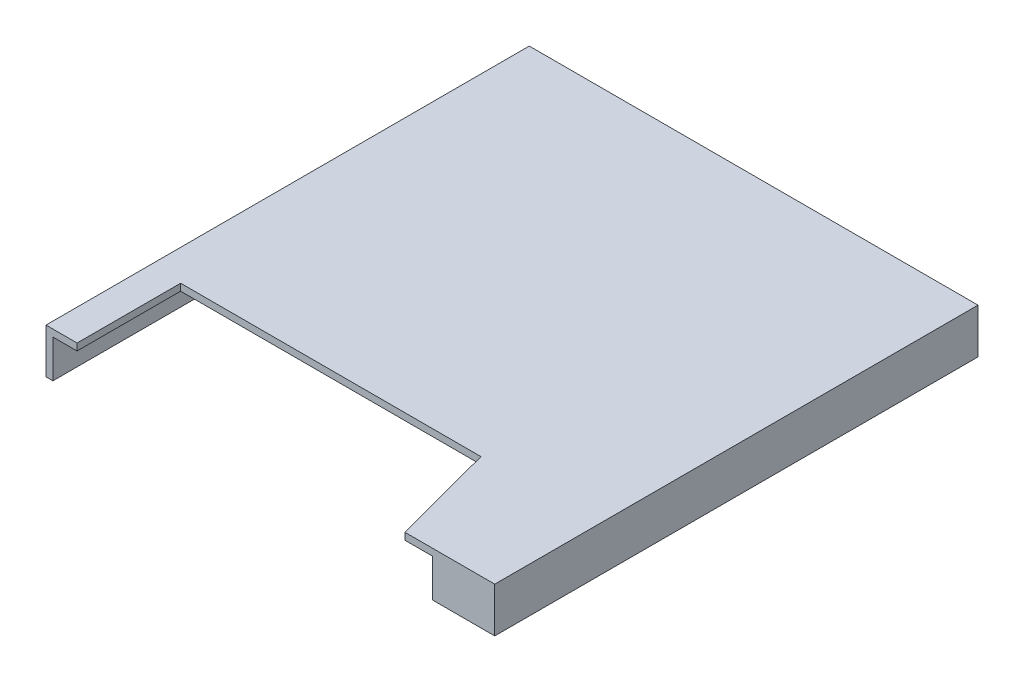
ISO-10303-21;
HEADER;
FILE_DESCRIPTION(('STEP AP214'),'2;1');
FILE_NAME('part.step','',(''),(''),'','','');
FILE_SCHEMA(('AUTOMOTIVE_DESIGN { 1 0 10303 214 1 1 1 1 }'));
ENDSEC;
DATA;
#1=APPLICATION_CONTEXT('core data for automotive mechanical design processes');
#2=APPLICATION_PROTOCOL_DEFINITION('international standard','automotive_design',2000,#1);
#3=PRODUCT_CONTEXT('',#1,'mechanical');
#4=PRODUCT('Part','Part','',(#3));
#5=PRODUCT_RELATED_PRODUCT_CATEGORY('part','',(#4));
#6=PRODUCT_DEFINITION_FORMATION('','',#4);
#7=PRODUCT_DEFINITION_CONTEXT('part definition',#1,'design');
#8=PRODUCT_DEFINITION('design','',#6,#7);
#9=PRODUCT_DEFINITION_SHAPE('','',#8);
#10=(LENGTH_UNIT() NAMED_UNIT(*) SI_UNIT(.MILLI.,.METRE.));
#11=(NAMED_UNIT(*) PLANE_ANGLE_UNIT() SI_UNIT($,.RADIAN.));
#12=(NAMED_UNIT(*) SI_UNIT($,.STERADIAN.) SOLID_ANGLE_UNIT());
#13=UNCERTAINTY_MEASURE_WITH_UNIT(LENGTH_MEASURE(1.E-05),#10,'distance_accuracy_value','');
#14=(GEOMETRIC_REPRESENTATION_CONTEXT(3) GLOBAL_UNCERTAINTY_ASSIGNED_CONTEXT((#13)) GLOBAL_UNIT_ASSIGNED_CONTEXT((#10,
#11,#12)) REPRESENTATION_CONTEXT('',''));
#15=CARTESIAN_POINT('',(0.,0.,0.));
#16=DIRECTION('',(0.,0.,1.));
#17=DIRECTION('',(1.,0.,0.));
#18=AXIS2_PLACEMENT_3D('',#15,#16,#17);
#19=CARTESIAN_POINT('',(-6.3,0.,-7.));
#20=DIRECTION('',(-1.,0.,0.));
#21=DIRECTION('',(0.,0.,1.));
#22=AXIS2_PLACEMENT_3D('',#19,#20,#21);
#23=PLANE('',#22);
#24=DIRECTION('',(0.,1.,0.));
#25=VECTOR('',#24,1.);
#26=CARTESIAN_POINT('',(-6.3,0.,7.));
#27=LINE('',#26,#25);
#28=CARTESIAN_POINT('',(-6.3,0.,7.));
#29=VERTEX_POINT('',#28);
#30=CARTESIAN_POINT('',(-6.3,1.1,7.));
#31=VERTEX_POINT('',#30);
#32=EDGE_CURVE('E19',#29,#31,#27,.T.);
#33=ORIENTED_EDGE('',*,*,#32,.F.);
#34=DIRECTION('',(0.,0.,1.));
#35=VECTOR('',#34,1.);
#36=CARTESIAN_POINT('',(-6.3,0.,0.));
#37=LINE('',#36,#35);
#38=CARTESIAN_POINT('',(-6.3,0.,-6.8));
#39=VERTEX_POINT('',#38);
#40=EDGE_CURVE('E195',#29,#39,#37,.F.);
#41=ORIENTED_EDGE('',*,*,#40,.T.);
#42=DIRECTION('',(0.,1.,0.));
#43=VECTOR('',#42,1.);
#44=CARTESIAN_POINT('',(-6.3,0.,-6.8));
#45=LINE('',#44,#43);
#46=CARTESIAN_POINT('',(-6.3,1.1,-6.8));
#47=VERTEX_POINT('',#46);
#48=EDGE_CURVE('E148',#39,#47,#45,.T.);
#49=ORIENTED_EDGE('',*,*,#48,.T.);
#50=DIRECTION('',(0.,0.,1.));
#51=VECTOR('',#50,1.);
#52=CARTESIAN_POINT('',(-6.3,1.1,0.));
#53=LINE('',#52,#51);
#54=EDGE_CURVE('E144',#47,#31,#53,.T.);
#55=ORIENTED_EDGE('',*,*,#54,.T.);
#56=EDGE_LOOP('',(#33,#41,#49,#55));
#57=FACE_BOUND('',#56,.T.);
#58=ADVANCED_FACE('F16',(#57),#23,.F.);
#59=CARTESIAN_POINT('',(6.5,0.,-6.8));
#60=DIRECTION('',(0.,0.,-1.));
#61=DIRECTION('',(-1.,0.,0.));
#62=AXIS2_PLACEMENT_3D('',#59,#60,#61);
#63=PLANE('',#62);
#64=ORIENTED_EDGE('',*,*,#48,.F.);
#65=DIRECTION('',(1.,0.,0.));
#66=VECTOR('',#65,1.);
#67=CARTESIAN_POINT('',(0.,0.,-6.8));
#68=LINE('',#67,#66);
#69=CARTESIAN_POINT('',(6.3,0.,-6.8));
#70=VERTEX_POINT('',#69);
#71=EDGE_CURVE('E193',#39,#70,#68,.T.);
#72=ORIENTED_EDGE('',*,*,#71,.T.);
#73=DIRECTION('',(0.,1.,0.));
#74=VECTOR('',#73,1.);
#75=CARTESIAN_POINT('',(6.3,0.,-6.8));
#76=LINE('',#75,#74);
#77=CARTESIAN_POINT('',(6.3,1.1,-6.8));
#78=VERTEX_POINT('',#77);
#79=EDGE_CURVE('E115',#70,#78,#76,.T.);
#80=ORIENTED_EDGE('',*,*,#79,.T.);
#81=DIRECTION('',(1.,0.,0.));
#82=VECTOR('',#81,1.);
#83=CARTESIAN_POINT('',(0.,1.1,-6.8));
#84=LINE('',#83,#82);
#85=EDGE_CURVE('E142',#78,#47,#84,.F.);
#86=ORIENTED_EDGE('',*,*,#85,.T.);
#87=EDGE_LOOP('',(#64,#72,#80,#86));
#88=FACE_BOUND('',#87,.T.);
#89=ADVANCED_FACE('F376',(#88),#63,.F.);
#90=CARTESIAN_POINT('',(6.3,0.,7.));
#91=DIRECTION('',(1.,0.,0.));
#92=DIRECTION('',(0.,0.,-1.));
#93=AXIS2_PLACEMENT_3D('',#90,#91,#92);
#94=PLANE('',#93);
#95=DIRECTION('',(0.,0.,1.));
#96=VECTOR('',#95,1.);
#97=CARTESIAN_POINT('',(6.3,0.,0.));
#98=LINE('',#97,#96);
#99=CARTESIAN_POINT('',(6.3,0.,6.8));
#100=VERTEX_POINT('',#99);
#101=EDGE_CURVE('E127',#70,#100,#98,.T.);
#102=ORIENTED_EDGE('',*,*,#101,.T.);
#103=DIRECTION('',(0.,1.,0.));
#104=VECTOR('',#103,1.);
#105=CARTESIAN_POINT('',(6.3,1.1,6.8));
#106=LINE('',#105,#104);
#107=CARTESIAN_POINT('',(6.3,1.1,6.8));
#108=VERTEX_POINT('',#107);
#109=EDGE_CURVE('E120',#108,#100,#106,.F.);
#110=ORIENTED_EDGE('',*,*,#109,.F.);
#111=DIRECTION('',(0.,0.,1.));
#112=VECTOR('',#111,1.);
#113=CARTESIAN_POINT('',(6.3,1.1,0.));
#114=LINE('',#113,#112);
#115=EDGE_CURVE('E124',#108,#78,#114,.F.);
#116=ORIENTED_EDGE('',*,*,#115,.T.);
#117=ORIENTED_EDGE('',*,*,#79,.F.);
#118=EDGE_LOOP('',(#102,#110,#116,#117));
#119=FACE_BOUND('',#118,.T.);
#120=ADVANCED_FACE('F122',(#119),#94,.F.);
#121=CARTESIAN_POINT('',(4.7,1.1,6.8));
#122=DIRECTION('',(0.,0.,-1.));
#123=DIRECTION('',(-1.,0.,0.));
#124=AXIS2_PLACEMENT_3D('',#121,#122,#123);
#125=PLANE('',#124);
#126=DIRECTION('',(1.,0.,0.));
#127=VECTOR('',#126,1.);
#128=CARTESIAN_POINT('',(0.,1.1,6.8));
#129=LINE('',#128,#127);
#130=CARTESIAN_POINT('',(4.7,1.1,6.8));
#131=VERTEX_POINT('',#130);
#132=EDGE_CURVE('E130',#131,#108,#129,.T.);
#133=ORIENTED_EDGE('',*,*,#132,.T.);
#134=ORIENTED_EDGE('',*,*,#109,.T.);
#135=DIRECTION('',(1.,0.,0.));
#136=VECTOR('',#135,1.);
#137=CARTESIAN_POINT('',(0.,0.,6.8));
#138=LINE('',#137,#136);
#139=CARTESIAN_POINT('',(4.7,0.,6.8));
#140=VERTEX_POINT('',#139);
#141=EDGE_CURVE('E190',#100,#140,#138,.F.);
#142=ORIENTED_EDGE('',*,*,#141,.T.);
#143=DIRECTION('',(0.,1.,0.));
#144=VECTOR('',#143,1.);
#145=CARTESIAN_POINT('',(4.7,1.1,6.8));
#146=LINE('',#145,#144);
#147=EDGE_CURVE('E135',#131,#140,#146,.F.);
#148=ORIENTED_EDGE('',*,*,#147,.F.);
#149=EDGE_LOOP('',(#133,#134,#142,#148));
#150=FACE_BOUND('',#149,.T.);
#151=ADVANCED_FACE('F133',(#150),#125,.T.);
#152=CARTESIAN_POINT('',(0.,1.1,0.));
#153=DIRECTION('',(0.,1.,0.));
#154=DIRECTION('',(0.,0.,1.));
#155=AXIS2_PLACEMENT_3D('',#152,#153,#154);
#156=PLANE('',#155);
#157=DIRECTION('',(-0.257662650560333,0.,-0.966234939601246));
#158=VECTOR('',#157,1.);
#159=CARTESIAN_POINT('',(3.1,1.1,4.));
#160=LINE('',#159,#158);
#161=CARTESIAN_POINT('',(3.9,1.1,7.));
#162=VERTEX_POINT('',#161);
#163=CARTESIAN_POINT('',(3.1,1.1,4.));
#164=VERTEX_POINT('',#163);
#165=EDGE_CURVE('E215',#162,#164,#160,.T.);
#166=ORIENTED_EDGE('',*,*,#165,.T.);
#167=DIRECTION('',(-1.,0.,0.));
#168=VECTOR('',#167,1.);
#169=CARTESIAN_POINT('',(-5.6,1.1,4.));
#170=LINE('',#169,#168);
#171=CARTESIAN_POINT('',(-5.6,1.1,4.));
#172=VERTEX_POINT('',#171);
#173=EDGE_CURVE('E222',#164,#172,#170,.T.);
#174=ORIENTED_EDGE('',*,*,#173,.T.);
#175=DIRECTION('',(0.,0.,1.));
#176=VECTOR('',#175,1.);
#177=CARTESIAN_POINT('',(-5.6,1.1,7.));
#178=LINE('',#177,#176);
#179=CARTESIAN_POINT('',(-5.6,1.1,7.));
#180=VERTEX_POINT('',#179);
#181=EDGE_CURVE('E165',#172,#180,#178,.T.);
#182=ORIENTED_EDGE('',*,*,#181,.T.);
#183=DIRECTION('',(1.,0.,0.));
#184=VECTOR('',#183,1.);
#185=CARTESIAN_POINT('',(-6.5,1.1,7.));
#186=LINE('',#185,#184);
#187=EDGE_CURVE('E157',#31,#180,#186,.T.);
#188=ORIENTED_EDGE('',*,*,#187,.F.);
#189=ORIENTED_EDGE('',*,*,#54,.F.);
#190=ORIENTED_EDGE('',*,*,#85,.F.);
#191=ORIENTED_EDGE('',*,*,#115,.F.);
#192=ORIENTED_EDGE('',*,*,#132,.F.);
#193=DIRECTION('',(0.,0.,1.));
#194=VECTOR('',#193,1.);
#195=CARTESIAN_POINT('',(4.7,1.1,7.));
#196=LINE('',#195,#194);
#197=CARTESIAN_POINT('',(4.7,1.1,7.));
#198=VERTEX_POINT('',#197);
#199=EDGE_CURVE('E198',#198,#131,#196,.F.);
#200=ORIENTED_EDGE('',*,*,#199,.F.);
#201=DIRECTION('',(1.,0.,0.));
#202=VECTOR('',#201,1.);
#203=CARTESIAN_POINT('',(0.,1.1,7.));
#204=LINE('',#203,#202);
#205=EDGE_CURVE('E163',#162,#198,#204,.T.);
#206=ORIENTED_EDGE('',*,*,#205,.F.);
#207=EDGE_LOOP('',(#166,#174,#182,#188,#189,#190,#191,#192,#200,#206));
#208=FACE_BOUND('',#207,.T.);
#209=ADVANCED_FACE('F140',(#208),#156,.F.);
#210=CARTESIAN_POINT('',(4.7,1.1,7.));
#211=DIRECTION('',(-1.,0.,0.));
#212=DIRECTION('',(0.,0.,1.));
#213=AXIS2_PLACEMENT_3D('',#210,#211,#212);
#214=PLANE('',#213);
#215=ORIENTED_EDGE('',*,*,#199,.T.);
#216=ORIENTED_EDGE('',*,*,#147,.T.);
#217=DIRECTION('',(0.,0.,1.));
#218=VECTOR('',#217,1.);
#219=CARTESIAN_POINT('',(4.7,0.,0.));
#220=LINE('',#219,#218);
#221=CARTESIAN_POINT('',(4.7,0.,7.));
#222=VERTEX_POINT('',#221);
#223=EDGE_CURVE('E188',#140,#222,#220,.T.);
#224=ORIENTED_EDGE('',*,*,#223,.T.);
#225=DIRECTION('',(0.,1.,0.));
#226=VECTOR('',#225,1.);
#227=CARTESIAN_POINT('',(4.7,0.,7.));
#228=LINE('',#227,#226);
#229=EDGE_CURVE('E205',#198,#222,#228,.F.);
#230=ORIENTED_EDGE('',*,*,#229,.F.);
#231=EDGE_LOOP('',(#215,#216,#224,#230));
#232=FACE_BOUND('',#231,.T.);
#233=ADVANCED_FACE('F207',(#232),#214,.T.);
#234=CARTESIAN_POINT('',(0.,0.,0.));
#235=DIRECTION('',(0.,1.,0.));
#236=DIRECTION('',(0.,0.,1.));
#237=AXIS2_PLACEMENT_3D('',#234,#235,#236);
#238=PLANE('',#237);
#239=DIRECTION('',(-1.,0.,0.));
#240=VECTOR('',#239,1.);
#241=CARTESIAN_POINT('',(6.5,0.,-7.));
#242=LINE('',#241,#240);
#243=CARTESIAN_POINT('',(6.5,0.,-7.));
#244=VERTEX_POINT('',#243);
#245=CARTESIAN_POINT('',(-6.5,0.,-7.));
#246=VERTEX_POINT('',#245);
#247=EDGE_CURVE('E182',#244,#246,#242,.T.);
#248=ORIENTED_EDGE('',*,*,#247,.F.);
#249=DIRECTION('',(0.,0.,-1.));
#250=VECTOR('',#249,1.);
#251=CARTESIAN_POINT('',(6.5,0.,7.));
#252=LINE('',#251,#250);
#253=CARTESIAN_POINT('',(6.5,0.,7.));
#254=VERTEX_POINT('',#253);
#255=EDGE_CURVE('E185',#254,#244,#252,.T.);
#256=ORIENTED_EDGE('',*,*,#255,.F.);
#257=DIRECTION('',(1.,0.,0.));
#258=VECTOR('',#257,1.);
#259=CARTESIAN_POINT('',(-6.5,0.,7.));
#260=LINE('',#259,#258);
#261=EDGE_CURVE('E210',#222,#254,#260,.T.);
#262=ORIENTED_EDGE('',*,*,#261,.F.);
#263=ORIENTED_EDGE('',*,*,#223,.F.);
#264=ORIENTED_EDGE('',*,*,#141,.F.);
#265=ORIENTED_EDGE('',*,*,#101,.F.);
#266=ORIENTED_EDGE('',*,*,#71,.F.);
#267=ORIENTED_EDGE('',*,*,#40,.F.);
#268=DIRECTION('',(1.,0.,0.));
#269=VECTOR('',#268,1.);
#270=CARTESIAN_POINT('',(-6.5,0.,7.));
#271=LINE('',#270,#269);
#272=CARTESIAN_POINT('',(-6.5,0.,7.));
#273=VERTEX_POINT('',#272);
#274=EDGE_CURVE('E161',#273,#29,#271,.T.);
#275=ORIENTED_EDGE('',*,*,#274,.F.);
#276=DIRECTION('',(0.,0.,1.));
#277=VECTOR('',#276,1.);
#278=CARTESIAN_POINT('',(-6.5,0.,-7.));
#279=LINE('',#278,#277);
#280=EDGE_CURVE('E177',#246,#273,#279,.T.);
#281=ORIENTED_EDGE('',*,*,#280,.F.);
#282=EDGE_LOOP('',(#248,#256,#262,#263,#264,#265,#266,#267,#275,#281));
#283=FACE_BOUND('',#282,.T.);
#284=ADVANCED_FACE('F339',(#283),#238,.F.);
#285=CARTESIAN_POINT('',(6.5,0.,7.));
#286=DIRECTION('',(1.,0.,0.));
#287=DIRECTION('',(0.,0.,-1.));
#288=AXIS2_PLACEMENT_3D('',#285,#286,#287);
#289=PLANE('',#288);
#290=DIRECTION('',(0.,0.,1.));
#291=VECTOR('',#290,1.);
#292=CARTESIAN_POINT('',(6.5,1.3,0.));
#293=LINE('',#292,#291);
#294=CARTESIAN_POINT('',(6.5,1.3,7.));
#295=VERTEX_POINT('',#294);
#296=CARTESIAN_POINT('',(6.5,1.3,-7.));
#297=VERTEX_POINT('',#296);
#298=EDGE_CURVE('E249',#295,#297,#293,.F.);
#299=ORIENTED_EDGE('',*,*,#298,.F.);
#300=DIRECTION('',(0.,1.,0.));
#301=VECTOR('',#300,1.);
#302=CARTESIAN_POINT('',(6.5,0.,7.));
#303=LINE('',#302,#301);
#304=EDGE_CURVE('E213',#254,#295,#303,.T.);
#305=ORIENTED_EDGE('',*,*,#304,.F.);
#306=ORIENTED_EDGE('',*,*,#255,.T.);
#307=DIRECTION('',(0.,1.,0.));
#308=VECTOR('',#307,1.);
#309=CARTESIAN_POINT('',(6.5,0.,-7.));
#310=LINE('',#309,#308);
#311=EDGE_CURVE('E179',#297,#244,#310,.F.);
#312=ORIENTED_EDGE('',*,*,#311,.F.);
#313=EDGE_LOOP('',(#299,#305,#306,#312));
#314=FACE_BOUND('',#313,.T.);
#315=ADVANCED_FACE('F330',(#314),#289,.T.);
#316=CARTESIAN_POINT('',(6.5,0.,-7.));
#317=DIRECTION('',(0.,0.,-1.));
#318=DIRECTION('',(-1.,0.,0.));
#319=AXIS2_PLACEMENT_3D('',#316,#317,#318);
#320=PLANE('',#319);
#321=DIRECTION('',(1.,0.,0.));
#322=VECTOR('',#321,1.);
#323=CARTESIAN_POINT('',(0.,1.3,-7.));
#324=LINE('',#323,#322);
#325=CARTESIAN_POINT('',(-6.5,1.3,-7.));
#326=VERTEX_POINT('',#325);
#327=EDGE_CURVE('E244',#297,#326,#324,.F.);
#328=ORIENTED_EDGE('',*,*,#327,.F.);
#329=ORIENTED_EDGE('',*,*,#311,.T.);
#330=ORIENTED_EDGE('',*,*,#247,.T.);
#331=DIRECTION('',(0.,1.,0.));
#332=VECTOR('',#331,1.);
#333=CARTESIAN_POINT('',(-6.5,0.,-7.));
#334=LINE('',#333,#332);
#335=EDGE_CURVE('E174',#326,#246,#334,.F.);
#336=ORIENTED_EDGE('',*,*,#335,.F.);
#337=EDGE_LOOP('',(#328,#329,#330,#336));
#338=FACE_BOUND('',#337,.T.);
#339=ADVANCED_FACE('F321',(#338),#320,.T.);
#340=CARTESIAN_POINT('',(-6.5,0.,-7.));
#341=DIRECTION('',(-1.,0.,0.));
#342=DIRECTION('',(0.,0.,1.));
#343=AXIS2_PLACEMENT_3D('',#340,#341,#342);
#344=PLANE('',#343);
#345=DIRECTION('',(0.,0.,1.));
#346=VECTOR('',#345,1.);
#347=CARTESIAN_POINT('',(-6.5,1.3,0.));
#348=LINE('',#347,#346);
#349=CARTESIAN_POINT('',(-6.5,1.3,7.));
#350=VERTEX_POINT('',#349);
#351=EDGE_CURVE('E242',#326,#350,#348,.T.);
#352=ORIENTED_EDGE('',*,*,#351,.F.);
#353=ORIENTED_EDGE('',*,*,#335,.T.);
#354=ORIENTED_EDGE('',*,*,#280,.T.);
#355=DIRECTION('',(0.,1.,0.));
#356=VECTOR('',#355,1.);
#357=CARTESIAN_POINT('',(-6.5,0.,7.));
#358=LINE('',#357,#356);
#359=EDGE_CURVE('E169',#350,#273,#358,.F.);
#360=ORIENTED_EDGE('',*,*,#359,.F.);
#361=EDGE_LOOP('',(#352,#353,#354,#360));
#362=FACE_BOUND('',#361,.T.);
#363=ADVANCED_FACE('F314',(#362),#344,.T.);
#364=CARTESIAN_POINT('',(-6.5,0.,7.));
#365=DIRECTION('',(0.,0.,1.));
#366=DIRECTION('',(1.,0.,0.));
#367=AXIS2_PLACEMENT_3D('',#364,#365,#366);
#368=PLANE('',#367);
#369=DIRECTION('',(0.,1.,0.));
#370=VECTOR('',#369,1.);
#371=CARTESIAN_POINT('',(-5.6,1.3,7.));
#372=LINE('',#371,#370);
#373=CARTESIAN_POINT('',(-5.6,1.3,7.));
#374=VERTEX_POINT('',#373);
#375=EDGE_CURVE('E167',#180,#374,#372,.T.);
#376=ORIENTED_EDGE('',*,*,#375,.T.);
#377=DIRECTION('',(1.,0.,0.));
#378=VECTOR('',#377,1.);
#379=CARTESIAN_POINT('',(0.,1.3,7.));
#380=LINE('',#379,#378);
#381=EDGE_CURVE('E226',#350,#374,#380,.T.);
#382=ORIENTED_EDGE('',*,*,#381,.F.);
#383=ORIENTED_EDGE('',*,*,#359,.T.);
#384=ORIENTED_EDGE('',*,*,#274,.T.);
#385=ORIENTED_EDGE('',*,*,#32,.T.);
#386=ORIENTED_EDGE('',*,*,#187,.T.);
#387=EDGE_LOOP('',(#376,#382,#383,#384,#385,#386));
#388=FACE_BOUND('',#387,.T.);
#389=ADVANCED_FACE('F155',(#388),#368,.T.);
#390=CARTESIAN_POINT('',(-5.6,1.3,7.));
#391=DIRECTION('',(-1.,0.,0.));
#392=DIRECTION('',(0.,0.,1.));
#393=AXIS2_PLACEMENT_3D('',#390,#391,#392);
#394=PLANE('',#393);
#395=ORIENTED_EDGE('',*,*,#375,.F.);
#396=ORIENTED_EDGE('',*,*,#181,.F.);
#397=DIRECTION('',(0.,1.,0.));
#398=VECTOR('',#397,1.);
#399=CARTESIAN_POINT('',(-5.6,1.3,4.));
#400=LINE('',#399,#398);
#401=CARTESIAN_POINT('',(-5.6,1.3,4.));
#402=VERTEX_POINT('',#401);
#403=EDGE_CURVE('E220',#172,#402,#400,.T.);
#404=ORIENTED_EDGE('',*,*,#403,.T.);
#405=DIRECTION('',(0.,0.,1.));
#406=VECTOR('',#405,1.);
#407=CARTESIAN_POINT('',(-5.6,1.3,0.));
#408=LINE('',#407,#406);
#409=EDGE_CURVE('E230',#374,#402,#408,.F.);
#410=ORIENTED_EDGE('',*,*,#409,.F.);
#411=EDGE_LOOP('',(#395,#396,#404,#410));
#412=FACE_BOUND('',#411,.T.);
#413=ADVANCED_FACE('F231',(#412),#394,.F.);
#414=CARTESIAN_POINT('',(-5.6,1.3,4.));
#415=DIRECTION('',(0.,0.,-1.));
#416=DIRECTION('',(-1.,0.,0.));
#417=AXIS2_PLACEMENT_3D('',#414,#415,#416);
#418=PLANE('',#417);
#419=ORIENTED_EDGE('',*,*,#403,.F.);
#420=ORIENTED_EDGE('',*,*,#173,.F.);
#421=DIRECTION('',(0.,1.,0.));
#422=VECTOR('',#421,1.);
#423=CARTESIAN_POINT('',(3.1,1.3,4.));
#424=LINE('',#423,#422);
#425=CARTESIAN_POINT('',(3.1,1.3,4.));
#426=VERTEX_POINT('',#425);
#427=EDGE_CURVE('E211',#164,#426,#424,.T.);
#428=ORIENTED_EDGE('',*,*,#427,.T.);
#429=DIRECTION('',(1.,0.,0.));
#430=VECTOR('',#429,1.);
#431=CARTESIAN_POINT('',(0.,1.3,4.));
#432=LINE('',#431,#430);
#433=EDGE_CURVE('E236',#402,#426,#432,.T.);
#434=ORIENTED_EDGE('',*,*,#433,.F.);
#435=EDGE_LOOP('',(#419,#420,#428,#434));
#436=FACE_BOUND('',#435,.T.);
#437=ADVANCED_FACE('F260',(#436),#418,.F.);
#438=CARTESIAN_POINT('',(3.1,1.3,4.));
#439=DIRECTION('',(0.966234939601246,0.,-0.257662650560333));
#440=DIRECTION('',(-0.257662650560333,0.,-0.966234939601246));
#441=AXIS2_PLACEMENT_3D('',#438,#439,#440);
#442=PLANE('',#441);
#443=ORIENTED_EDGE('',*,*,#427,.F.);
#444=ORIENTED_EDGE('',*,*,#165,.F.);
#445=DIRECTION('',(0.,1.,0.));
#446=VECTOR('',#445,1.);
#447=CARTESIAN_POINT('',(3.9,0.,7.));
#448=LINE('',#447,#446);
#449=CARTESIAN_POINT('',(3.9,1.3,7.));
#450=VERTEX_POINT('',#449);
#451=EDGE_CURVE('E34',#450,#162,#448,.F.);
#452=ORIENTED_EDGE('',*,*,#451,.F.);
#453=DIRECTION('',(0.257662650560333,0.,0.966234939601246));
#454=VECTOR('',#453,1.);
#455=CARTESIAN_POINT('',(3.1,1.3,4.));
#456=LINE('',#455,#454);
#457=EDGE_CURVE('E25',#426,#450,#456,.T.);
#458=ORIENTED_EDGE('',*,*,#457,.F.);
#459=EDGE_LOOP('',(#443,#444,#452,#458));
#460=FACE_BOUND('',#459,.T.);
#461=ADVANCED_FACE('F257',(#460),#442,.F.);
#462=CARTESIAN_POINT('',(-6.5,0.,7.));
#463=DIRECTION('',(0.,0.,1.));
#464=DIRECTION('',(1.,0.,0.));
#465=AXIS2_PLACEMENT_3D('',#462,#463,#464);
#466=PLANE('',#465);
#467=ORIENTED_EDGE('',*,*,#451,.T.);
#468=ORIENTED_EDGE('',*,*,#205,.T.);
#469=ORIENTED_EDGE('',*,*,#229,.T.);
#470=ORIENTED_EDGE('',*,*,#261,.T.);
#471=ORIENTED_EDGE('',*,*,#304,.T.);
#472=DIRECTION('',(1.,0.,0.));
#473=VECTOR('',#472,1.);
#474=CARTESIAN_POINT('',(0.,1.3,7.));
#475=LINE('',#474,#473);
#476=EDGE_CURVE('E11',#450,#295,#475,.T.);
#477=ORIENTED_EDGE('',*,*,#476,.F.);
#478=EDGE_LOOP('',(#467,#468,#469,#470,#471,#477));
#479=FACE_BOUND('',#478,.T.);
#480=ADVANCED_FACE('F202',(#479),#466,.T.);
#481=CARTESIAN_POINT('',(0.,1.3,0.));
#482=DIRECTION('',(0.,1.,0.));
#483=DIRECTION('',(0.,0.,1.));
#484=AXIS2_PLACEMENT_3D('',#481,#482,#483);
#485=PLANE('',#484);
#486=ORIENTED_EDGE('',*,*,#457,.T.);
#487=ORIENTED_EDGE('',*,*,#476,.T.);
#488=ORIENTED_EDGE('',*,*,#298,.T.);
#489=ORIENTED_EDGE('',*,*,#327,.T.);
#490=ORIENTED_EDGE('',*,*,#351,.T.);
#491=ORIENTED_EDGE('',*,*,#381,.T.);
#492=ORIENTED_EDGE('',*,*,#409,.T.);
#493=ORIENTED_EDGE('',*,*,#433,.T.);
#494=EDGE_LOOP('',(#486,#487,#488,#489,#490,#491,#492,#493));
#495=FACE_BOUND('',#494,.T.);
#496=ADVANCED_FACE('F239',(#495),#485,.T.);
#497=CLOSED_SHELL('',(#58,#89,#120,#151,#209,#233,#284,#315,#339,#363,#389,#413,#437,#461,#480,#496));
#498=MANIFOLD_SOLID_BREP('B1',#497);
#499=ADVANCED_BREP_SHAPE_REPRESENTATION('',(#18,#498),#14);
#500=SHAPE_DEFINITION_REPRESENTATION(#9,#499);
ENDSEC;
END-ISO-10303-21;
